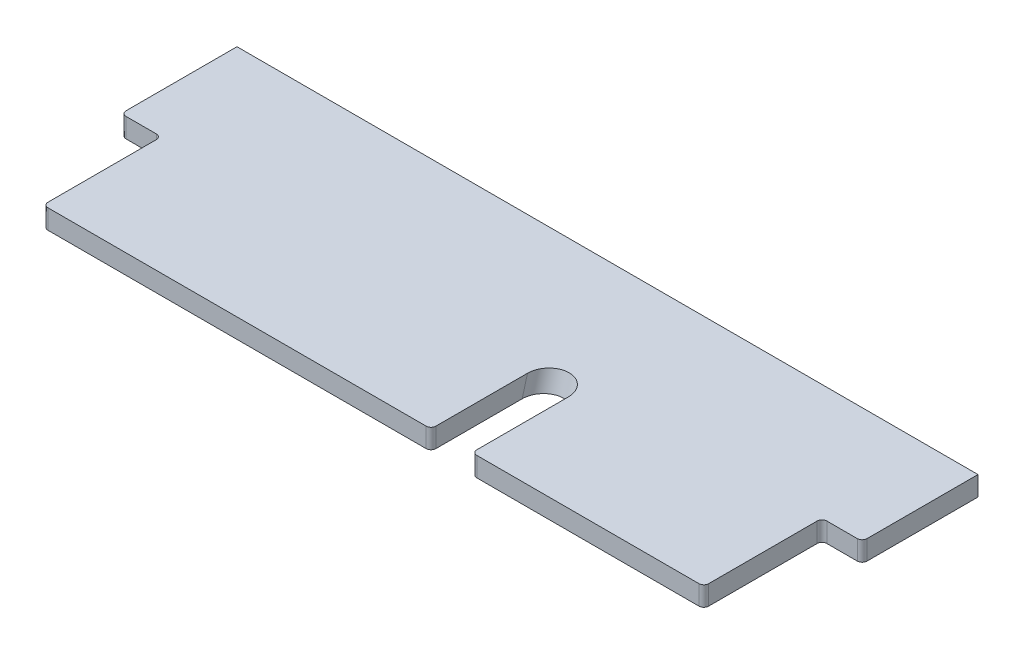
ISO-10303-21;
HEADER;
FILE_DESCRIPTION(('STEP AP214'),'2;1');
FILE_NAME('part.step','',(''),(''),'','','');
FILE_SCHEMA(('AUTOMOTIVE_DESIGN { 1 0 10303 214 1 1 1 1 }'));
ENDSEC;
DATA;
#1=APPLICATION_CONTEXT('core data for automotive mechanical design processes');
#2=APPLICATION_PROTOCOL_DEFINITION('international standard','automotive_design',2000,#1);
#3=PRODUCT_CONTEXT('',#1,'mechanical');
#4=PRODUCT('Part','Part','',(#3));
#5=PRODUCT_RELATED_PRODUCT_CATEGORY('part','',(#4));
#6=PRODUCT_DEFINITION_FORMATION('','',#4);
#7=PRODUCT_DEFINITION_CONTEXT('part definition',#1,'design');
#8=PRODUCT_DEFINITION('design','',#6,#7);
#9=PRODUCT_DEFINITION_SHAPE('','',#8);
#10=(LENGTH_UNIT() NAMED_UNIT(*) SI_UNIT(.MILLI.,.METRE.));
#11=(NAMED_UNIT(*) PLANE_ANGLE_UNIT() SI_UNIT($,.RADIAN.));
#12=(NAMED_UNIT(*) SI_UNIT($,.STERADIAN.) SOLID_ANGLE_UNIT());
#13=UNCERTAINTY_MEASURE_WITH_UNIT(LENGTH_MEASURE(1.E-05),#10,'distance_accuracy_value','');
#14=(GEOMETRIC_REPRESENTATION_CONTEXT(3) GLOBAL_UNCERTAINTY_ASSIGNED_CONTEXT((#13)) GLOBAL_UNIT_ASSIGNED_CONTEXT((#10,
#11,#12)) REPRESENTATION_CONTEXT('',''));
#15=CARTESIAN_POINT('',(0.,0.,0.));
#16=DIRECTION('',(0.,0.,1.));
#17=DIRECTION('',(1.,0.,0.));
#18=AXIS2_PLACEMENT_3D('',#15,#16,#17);
#19=CARTESIAN_POINT('',(-215.9,6.35,76.2));
#20=DIRECTION('',(0.,0.,-1.));
#21=DIRECTION('',(-1.,0.,0.));
#22=AXIS2_PLACEMENT_3D('',#19,#20,#21);
#23=PLANE('',#22);
#24=DIRECTION('',(1.,0.,0.));
#25=VECTOR('',#24,1.);
#26=CARTESIAN_POINT('',(-215.9,6.35,76.2));
#27=LINE('',#26,#25);
#28=CARTESIAN_POINT('',(-211.963,6.35,76.2));
#29=VERTEX_POINT('',#28);
#30=CARTESIAN_POINT('',(34.2899999999999,6.35,76.2));
#31=VERTEX_POINT('',#30);
#32=EDGE_CURVE('E222',#29,#31,#27,.T.);
#33=ORIENTED_EDGE('',*,*,#32,.F.);
#34=DIRECTION('',(0.,-1.,0.));
#35=VECTOR('',#34,1.);
#36=CARTESIAN_POINT('',(-211.963,6.35,76.2));
#37=LINE('',#36,#35);
#38=CARTESIAN_POINT('',(-211.963,-6.35,76.2));
#39=VERTEX_POINT('',#38);
#40=EDGE_CURVE('E344',#29,#39,#37,.T.);
#41=ORIENTED_EDGE('',*,*,#40,.T.);
#42=DIRECTION('',(1.,0.,0.));
#43=VECTOR('',#42,1.);
#44=CARTESIAN_POINT('',(-215.9,-6.35,76.2));
#45=LINE('',#44,#43);
#46=CARTESIAN_POINT('',(34.2899999999999,-6.35,76.2));
#47=VERTEX_POINT('',#46);
#48=EDGE_CURVE('E292',#39,#47,#45,.T.);
#49=ORIENTED_EDGE('',*,*,#48,.T.);
#50=DIRECTION('',(0.,-1.,0.));
#51=VECTOR('',#50,1.);
#52=CARTESIAN_POINT('',(34.2899999999999,6.35,76.2));
#53=LINE('',#52,#51);
#54=EDGE_CURVE('E60',#47,#31,#53,.F.);
#55=ORIENTED_EDGE('',*,*,#54,.T.);
#56=EDGE_LOOP('',(#33,#41,#49,#55));
#57=FACE_BOUND('',#56,.T.);
#58=ADVANCED_FACE('F44',(#57),#23,.F.);
#59=CARTESIAN_POINT('',(50.7999999999986,94.7896928963142,-10.6042856199856));
#60=DIRECTION('',(0.,-0.965182723476007,0.261576585923584));
#61=DIRECTION('',(0.,-0.261576585923584,-0.965182723476007));
#62=AXIS2_PLACEMENT_3D('',#59,#60,#61);
#63=CYLINDRICAL_SURFACE('',#62,13.3350000000001);
#64=CARTESIAN_POINT('',(50.7999999999986,6.34999999999999,13.363976933072));
#65=DIRECTION('',(0.,1.,0.));
#66=DIRECTION('',(0.,0.,1.));
#67=AXIS2_PLACEMENT_3D('',#64,#65,#66);
#68=ELLIPSE('',#67,13.8160367727838,13.3350000000001);
#69=CARTESIAN_POINT('',(37.4649999999999,6.34999999999999,13.363976933072));
#70=VERTEX_POINT('',#69);
#71=CARTESIAN_POINT('',(64.135,6.34999999999999,13.363976933072));
#72=VERTEX_POINT('',#71);
#73=EDGE_CURVE('E246',#70,#72,#68,.F.);
#74=ORIENTED_EDGE('',*,*,#73,.F.);
#75=DIRECTION('',(0.,-0.965182723476007,0.261576585923584));
#76=VECTOR('',#75,1.);
#77=CARTESIAN_POINT('',(37.4649999999985,94.7896928963142,-10.6042856199856));
#78=LINE('',#77,#76);
#79=CARTESIAN_POINT('',(37.4649999999999,-6.34999999999999,16.8058357235667));
#80=VERTEX_POINT('',#79);
#81=EDGE_CURVE('E269',#80,#70,#78,.F.);
#82=ORIENTED_EDGE('',*,*,#81,.F.);
#83=CARTESIAN_POINT('',(50.7999999999986,-6.34999999999999,16.8058357235667));
#84=DIRECTION('',(0.,1.,0.));
#85=DIRECTION('',(0.,0.,1.));
#86=AXIS2_PLACEMENT_3D('',#83,#84,#85);
#87=ELLIPSE('',#86,13.8160367727838,13.3350000000001);
#88=CARTESIAN_POINT('',(64.135,-6.34999999999999,16.8058357235667));
#89=VERTEX_POINT('',#88);
#90=EDGE_CURVE('E225',#80,#89,#87,.F.);
#91=ORIENTED_EDGE('',*,*,#90,.T.);
#92=DIRECTION('',(0.,-0.965182723476007,0.261576585923584));
#93=VECTOR('',#92,1.);
#94=CARTESIAN_POINT('',(64.1349999999987,94.7896928963142,-10.6042856199856));
#95=LINE('',#94,#93);
#96=EDGE_CURVE('E241',#89,#72,#95,.F.);
#97=ORIENTED_EDGE('',*,*,#96,.T.);
#98=EDGE_LOOP('',(#74,#82,#91,#97));
#99=FACE_BOUND('',#98,.T.);
#100=ADVANCED_FACE('F457',(#99),#63,.F.);
#101=CARTESIAN_POINT('',(215.138,6.35,0.));
#102=DIRECTION('',(-1.,0.,0.));
#103=DIRECTION('',(0.,0.,1.));
#104=AXIS2_PLACEMENT_3D('',#101,#102,#103);
#105=PLANE('',#104);
#106=DIRECTION('',(0.,0.,-1.));
#107=VECTOR('',#106,1.);
#108=CARTESIAN_POINT('',(215.138,6.35,0.));
#109=LINE('',#108,#107);
#110=CARTESIAN_POINT('',(215.138,6.35,73.025));
#111=VERTEX_POINT('',#110);
#112=CARTESIAN_POINT('',(215.138,6.35,2.41300000000001));
#113=VERTEX_POINT('',#112);
#114=EDGE_CURVE('E242',#111,#113,#109,.T.);
#115=ORIENTED_EDGE('',*,*,#114,.F.);
#116=DIRECTION('',(0.,-1.,0.));
#117=VECTOR('',#116,1.);
#118=CARTESIAN_POINT('',(215.138,6.35,73.025));
#119=LINE('',#118,#117);
#120=CARTESIAN_POINT('',(215.138,-6.35,73.025));
#121=VERTEX_POINT('',#120);
#122=EDGE_CURVE('E298',#111,#121,#119,.T.);
#123=ORIENTED_EDGE('',*,*,#122,.T.);
#124=DIRECTION('',(0.,0.,-1.));
#125=VECTOR('',#124,1.);
#126=CARTESIAN_POINT('',(215.138,-6.35,0.));
#127=LINE('',#126,#125);
#128=CARTESIAN_POINT('',(215.138,-6.35,2.41300000000001));
#129=VERTEX_POINT('',#128);
#130=EDGE_CURVE('E237',#121,#129,#127,.T.);
#131=ORIENTED_EDGE('',*,*,#130,.T.);
#132=DIRECTION('',(0.,-1.,0.));
#133=VECTOR('',#132,1.);
#134=CARTESIAN_POINT('',(215.138,6.35,2.41300000000001));
#135=LINE('',#134,#133);
#136=EDGE_CURVE('E281',#129,#113,#135,.F.);
#137=ORIENTED_EDGE('',*,*,#136,.T.);
#138=EDGE_LOOP('',(#115,#123,#131,#137));
#139=FACE_BOUND('',#138,.T.);
#140=ADVANCED_FACE('F396',(#139),#105,.F.);
#141=CARTESIAN_POINT('',(215.9,6.35,-0.761999999999986));
#142=DIRECTION('',(0.,0.,-1.));
#143=DIRECTION('',(-1.,0.,0.));
#144=AXIS2_PLACEMENT_3D('',#141,#142,#143);
#145=PLANE('',#144);
#146=DIRECTION('',(1.,0.,0.));
#147=VECTOR('',#146,1.);
#148=CARTESIAN_POINT('',(215.9,-6.35,-0.761999999999986));
#149=LINE('',#148,#147);
#150=CARTESIAN_POINT('',(218.313,-6.35,-0.761999999999986));
#151=VERTEX_POINT('',#150);
#152=CARTESIAN_POINT('',(238.125,-6.35,-0.761999999999986));
#153=VERTEX_POINT('',#152);
#154=EDGE_CURVE('E221',#151,#153,#149,.T.);
#155=ORIENTED_EDGE('',*,*,#154,.T.);
#156=DIRECTION('',(0.,-1.,0.));
#157=VECTOR('',#156,1.);
#158=CARTESIAN_POINT('',(238.125,6.35,-0.761999999999986));
#159=LINE('',#158,#157);
#160=CARTESIAN_POINT('',(238.125,6.35,-0.761999999999986));
#161=VERTEX_POINT('',#160);
#162=EDGE_CURVE('E373',#153,#161,#159,.F.);
#163=ORIENTED_EDGE('',*,*,#162,.T.);
#164=DIRECTION('',(1.,0.,0.));
#165=VECTOR('',#164,1.);
#166=CARTESIAN_POINT('',(215.9,6.35,-0.761999999999986));
#167=LINE('',#166,#165);
#168=CARTESIAN_POINT('',(218.313,6.35,-0.761999999999986));
#169=VERTEX_POINT('',#168);
#170=EDGE_CURVE('E236',#169,#161,#167,.T.);
#171=ORIENTED_EDGE('',*,*,#170,.F.);
#172=DIRECTION('',(0.,-1.,0.));
#173=VECTOR('',#172,1.);
#174=CARTESIAN_POINT('',(218.313,-6.35,-0.761999999999986));
#175=LINE('',#174,#173);
#176=EDGE_CURVE('E369',#169,#151,#175,.T.);
#177=ORIENTED_EDGE('',*,*,#176,.T.);
#178=EDGE_LOOP('',(#155,#163,#171,#177));
#179=FACE_BOUND('',#178,.T.);
#180=ADVANCED_FACE('F405',(#179),#145,.F.);
#181=CARTESIAN_POINT('',(241.3,6.35,-76.2));
#182=DIRECTION('',(-1.,0.,0.));
#183=DIRECTION('',(0.,0.,1.));
#184=AXIS2_PLACEMENT_3D('',#181,#182,#183);
#185=PLANE('',#184);
#186=DIRECTION('',(0.,0.,-1.));
#187=VECTOR('',#186,1.);
#188=CARTESIAN_POINT('',(241.3,6.35,-76.2));
#189=LINE('',#188,#187);
#190=CARTESIAN_POINT('',(241.3,6.35,-3.93700000000001));
#191=VERTEX_POINT('',#190);
#192=CARTESIAN_POINT('',(241.3,6.35,-76.2));
#193=VERTEX_POINT('',#192);
#194=EDGE_CURVE('E233',#191,#193,#189,.T.);
#195=ORIENTED_EDGE('',*,*,#194,.F.);
#196=DIRECTION('',(0.,-1.,0.));
#197=VECTOR('',#196,1.);
#198=CARTESIAN_POINT('',(241.3,6.35,-3.93699999999998));
#199=LINE('',#198,#197);
#200=CARTESIAN_POINT('',(241.3,-6.35,-3.93700000000001));
#201=VERTEX_POINT('',#200);
#202=EDGE_CURVE('E365',#191,#201,#199,.T.);
#203=ORIENTED_EDGE('',*,*,#202,.T.);
#204=DIRECTION('',(0.,0.,-1.));
#205=VECTOR('',#204,1.);
#206=CARTESIAN_POINT('',(241.3,-6.35,-76.2));
#207=LINE('',#206,#205);
#208=CARTESIAN_POINT('',(241.3,-6.35,-76.2));
#209=VERTEX_POINT('',#208);
#210=EDGE_CURVE('E196',#201,#209,#207,.T.);
#211=ORIENTED_EDGE('',*,*,#210,.T.);
#212=DIRECTION('',(0.,-1.,0.));
#213=VECTOR('',#212,1.);
#214=CARTESIAN_POINT('',(241.3,6.35,-76.2));
#215=LINE('',#214,#213);
#216=EDGE_CURVE('E191',#193,#209,#215,.T.);
#217=ORIENTED_EDGE('',*,*,#216,.F.);
#218=EDGE_LOOP('',(#195,#203,#211,#217));
#219=FACE_BOUND('',#218,.T.);
#220=ADVANCED_FACE('F412',(#219),#185,.F.);
#221=CARTESIAN_POINT('',(-215.9,6.35,-76.2));
#222=DIRECTION('',(0.,0.,1.));
#223=DIRECTION('',(1.,0.,0.));
#224=AXIS2_PLACEMENT_3D('',#221,#222,#223);
#225=PLANE('',#224);
#226=DIRECTION('',(-1.,0.,0.));
#227=VECTOR('',#226,1.);
#228=CARTESIAN_POINT('',(-215.9,-6.35,-76.2));
#229=LINE('',#228,#227);
#230=CARTESIAN_POINT('',(-241.3,-6.35,-76.2));
#231=VERTEX_POINT('',#230);
#232=EDGE_CURVE('E184',#209,#231,#229,.T.);
#233=ORIENTED_EDGE('',*,*,#232,.T.);
#234=DIRECTION('',(0.,-1.,0.));
#235=VECTOR('',#234,1.);
#236=CARTESIAN_POINT('',(-241.3,6.35,-76.2));
#237=LINE('',#236,#235);
#238=CARTESIAN_POINT('',(-241.3,6.35,-76.2));
#239=VERTEX_POINT('',#238);
#240=EDGE_CURVE('E188',#239,#231,#237,.T.);
#241=ORIENTED_EDGE('',*,*,#240,.F.);
#242=DIRECTION('',(-1.,0.,0.));
#243=VECTOR('',#242,1.);
#244=CARTESIAN_POINT('',(215.9,6.35,-76.2));
#245=LINE('',#244,#243);
#246=EDGE_CURVE('E230',#193,#239,#245,.T.);
#247=ORIENTED_EDGE('',*,*,#246,.F.);
#248=ORIENTED_EDGE('',*,*,#216,.T.);
#249=EDGE_LOOP('',(#233,#241,#247,#248));
#250=FACE_BOUND('',#249,.T.);
#251=ADVANCED_FACE('F186',(#250),#225,.F.);
#252=CARTESIAN_POINT('',(-241.3,6.35,-76.2));
#253=DIRECTION('',(1.,0.,0.));
#254=DIRECTION('',(0.,0.,-1.));
#255=AXIS2_PLACEMENT_3D('',#252,#253,#254);
#256=PLANE('',#255);
#257=DIRECTION('',(0.,0.,1.));
#258=VECTOR('',#257,1.);
#259=CARTESIAN_POINT('',(-241.3,-6.35,-76.2));
#260=LINE('',#259,#258);
#261=CARTESIAN_POINT('',(-241.3,-6.35,-3.93700000000001));
#262=VERTEX_POINT('',#261);
#263=EDGE_CURVE('E201',#231,#262,#260,.T.);
#264=ORIENTED_EDGE('',*,*,#263,.T.);
#265=DIRECTION('',(0.,-1.,0.));
#266=VECTOR('',#265,1.);
#267=CARTESIAN_POINT('',(-241.3,6.35,-3.93699999999998));
#268=LINE('',#267,#266);
#269=CARTESIAN_POINT('',(-241.3,6.35,-3.93700000000001));
#270=VERTEX_POINT('',#269);
#271=EDGE_CURVE('E362',#262,#270,#268,.F.);
#272=ORIENTED_EDGE('',*,*,#271,.T.);
#273=DIRECTION('',(0.,0.,1.));
#274=VECTOR('',#273,1.);
#275=CARTESIAN_POINT('',(-241.3,6.35,-76.2));
#276=LINE('',#275,#274);
#277=EDGE_CURVE('E204',#239,#270,#276,.T.);
#278=ORIENTED_EDGE('',*,*,#277,.F.);
#279=ORIENTED_EDGE('',*,*,#240,.T.);
#280=EDGE_LOOP('',(#264,#272,#278,#279));
#281=FACE_BOUND('',#280,.T.);
#282=ADVANCED_FACE('F200',(#281),#256,.F.);
#283=CARTESIAN_POINT('',(-215.9,6.35,-0.76199999999999));
#284=DIRECTION('',(0.,0.,-1.));
#285=DIRECTION('',(-1.,0.,0.));
#286=AXIS2_PLACEMENT_3D('',#283,#284,#285);
#287=PLANE('',#286);
#288=DIRECTION('',(1.,0.,0.));
#289=VECTOR('',#288,1.);
#290=CARTESIAN_POINT('',(-215.9,-6.35,-0.76199999999999));
#291=LINE('',#290,#289);
#292=CARTESIAN_POINT('',(-238.125,-6.35,-0.761999999999987));
#293=VERTEX_POINT('',#292);
#294=CARTESIAN_POINT('',(-218.313,-6.35,-0.761999999999989));
#295=VERTEX_POINT('',#294);
#296=EDGE_CURVE('E206',#293,#295,#291,.T.);
#297=ORIENTED_EDGE('',*,*,#296,.T.);
#298=DIRECTION('',(0.,-1.,0.));
#299=VECTOR('',#298,1.);
#300=CARTESIAN_POINT('',(-218.313,6.35,-0.761999999999989));
#301=LINE('',#300,#299);
#302=CARTESIAN_POINT('',(-218.313,6.35,-0.761999999999989));
#303=VERTEX_POINT('',#302);
#304=EDGE_CURVE('E359',#295,#303,#301,.F.);
#305=ORIENTED_EDGE('',*,*,#304,.T.);
#306=DIRECTION('',(1.,0.,0.));
#307=VECTOR('',#306,1.);
#308=CARTESIAN_POINT('',(-215.9,6.35,-0.76199999999999));
#309=LINE('',#308,#307);
#310=CARTESIAN_POINT('',(-238.125,6.35,-0.761999999999987));
#311=VERTEX_POINT('',#310);
#312=EDGE_CURVE('E229',#311,#303,#309,.T.);
#313=ORIENTED_EDGE('',*,*,#312,.F.);
#314=DIRECTION('',(0.,-1.,0.));
#315=VECTOR('',#314,1.);
#316=CARTESIAN_POINT('',(-238.125,6.35,-0.761999999999987));
#317=LINE('',#316,#315);
#318=EDGE_CURVE('E355',#311,#293,#317,.T.);
#319=ORIENTED_EDGE('',*,*,#318,.T.);
#320=EDGE_LOOP('',(#297,#305,#313,#319));
#321=FACE_BOUND('',#320,.T.);
#322=ADVANCED_FACE('F419',(#321),#287,.F.);
#323=CARTESIAN_POINT('',(-215.138,6.35,0.));
#324=DIRECTION('',(1.,0.,0.));
#325=DIRECTION('',(0.,0.,-1.));
#326=AXIS2_PLACEMENT_3D('',#323,#324,#325);
#327=PLANE('',#326);
#328=DIRECTION('',(0.,0.,1.));
#329=VECTOR('',#328,1.);
#330=CARTESIAN_POINT('',(-215.138,-6.35,0.));
#331=LINE('',#330,#329);
#332=CARTESIAN_POINT('',(-215.138,-6.35,2.41300000000001));
#333=VERTEX_POINT('',#332);
#334=CARTESIAN_POINT('',(-215.138,-6.35,73.025));
#335=VERTEX_POINT('',#334);
#336=EDGE_CURVE('E253',#333,#335,#331,.T.);
#337=ORIENTED_EDGE('',*,*,#336,.T.);
#338=DIRECTION('',(0.,-1.,0.));
#339=VECTOR('',#338,1.);
#340=CARTESIAN_POINT('',(-215.138,6.35,73.025));
#341=LINE('',#340,#339);
#342=CARTESIAN_POINT('',(-215.138,6.35,73.025));
#343=VERTEX_POINT('',#342);
#344=EDGE_CURVE('E352',#335,#343,#341,.F.);
#345=ORIENTED_EDGE('',*,*,#344,.T.);
#346=DIRECTION('',(0.,0.,1.));
#347=VECTOR('',#346,1.);
#348=CARTESIAN_POINT('',(-215.138,6.35,0.));
#349=LINE('',#348,#347);
#350=CARTESIAN_POINT('',(-215.138,6.35,2.41300000000001));
#351=VERTEX_POINT('',#350);
#352=EDGE_CURVE('E263',#351,#343,#349,.T.);
#353=ORIENTED_EDGE('',*,*,#352,.F.);
#354=DIRECTION('',(0.,-1.,0.));
#355=VECTOR('',#354,1.);
#356=CARTESIAN_POINT('',(-215.138,-6.35,2.41300000000001));
#357=LINE('',#356,#355);
#358=EDGE_CURVE('E348',#351,#333,#357,.T.);
#359=ORIENTED_EDGE('',*,*,#358,.T.);
#360=EDGE_LOOP('',(#337,#345,#353,#359));
#361=FACE_BOUND('',#360,.T.);
#362=ADVANCED_FACE('F428',(#361),#327,.F.);
#363=CARTESIAN_POINT('',(67.31,-6.35,76.2));
#364=VERTEX_POINT('',#363);
#365=CARTESIAN_POINT('',(211.963,-6.35,76.2));
#366=VERTEX_POINT('',#365);
#367=EDGE_CURVE('E217',#364,#366,#45,.T.);
#368=ORIENTED_EDGE('',*,*,#367,.T.);
#369=DIRECTION('',(0.,-1.,0.));
#370=VECTOR('',#369,1.);
#371=CARTESIAN_POINT('',(211.963,6.35,76.2));
#372=LINE('',#371,#370);
#373=CARTESIAN_POINT('',(211.963,6.35,76.2));
#374=VERTEX_POINT('',#373);
#375=EDGE_CURVE('E322',#366,#374,#372,.F.);
#376=ORIENTED_EDGE('',*,*,#375,.T.);
#377=CARTESIAN_POINT('',(67.31,6.35,76.2));
#378=VERTEX_POINT('',#377);
#379=EDGE_CURVE('E226',#378,#374,#27,.T.);
#380=ORIENTED_EDGE('',*,*,#379,.F.);
#381=DIRECTION('',(0.,1.,0.));
#382=VECTOR('',#381,1.);
#383=CARTESIAN_POINT('',(67.31,6.35,76.2));
#384=LINE('',#383,#382);
#385=EDGE_CURVE('E319',#378,#364,#384,.F.);
#386=ORIENTED_EDGE('',*,*,#385,.T.);
#387=EDGE_LOOP('',(#368,#376,#380,#386));
#388=FACE_BOUND('',#387,.T.);
#389=ADVANCED_FACE('F440',(#388),#23,.F.);
#390=CARTESIAN_POINT('',(0.,6.35,0.));
#391=DIRECTION('',(0.,1.,0.));
#392=DIRECTION('',(0.,0.,1.));
#393=AXIS2_PLACEMENT_3D('',#390,#391,#392);
#394=PLANE('',#393);
#395=ORIENTED_EDGE('',*,*,#379,.T.);
#396=CARTESIAN_POINT('',(211.963,6.35,73.025));
#397=DIRECTION('',(0.,1.,0.));
#398=DIRECTION('',(0.,0.,1.));
#399=AXIS2_PLACEMENT_3D('',#396,#397,#398);
#400=CIRCLE('',#399,3.175);
#401=EDGE_CURVE('E339',#374,#111,#400,.T.);
#402=ORIENTED_EDGE('',*,*,#401,.T.);
#403=ORIENTED_EDGE('',*,*,#114,.T.);
#404=CARTESIAN_POINT('',(218.313,6.35,2.41300000000001));
#405=DIRECTION('',(0.,1.,0.));
#406=DIRECTION('',(0.,0.,1.));
#407=AXIS2_PLACEMENT_3D('',#404,#405,#406);
#408=CIRCLE('',#407,3.175);
#409=EDGE_CURVE('E12',#113,#169,#408,.F.);
#410=ORIENTED_EDGE('',*,*,#409,.T.);
#411=ORIENTED_EDGE('',*,*,#170,.T.);
#412=CARTESIAN_POINT('',(238.125,6.35,-3.93699999999998));
#413=DIRECTION('',(0.,1.,0.));
#414=DIRECTION('',(0.,0.,1.));
#415=AXIS2_PLACEMENT_3D('',#412,#413,#414);
#416=CIRCLE('',#415,3.175);
#417=EDGE_CURVE('E331',#161,#191,#416,.T.);
#418=ORIENTED_EDGE('',*,*,#417,.T.);
#419=ORIENTED_EDGE('',*,*,#194,.T.);
#420=ORIENTED_EDGE('',*,*,#246,.T.);
#421=ORIENTED_EDGE('',*,*,#277,.T.);
#422=CARTESIAN_POINT('',(-238.125,6.35,-3.93699999999999));
#423=DIRECTION('',(0.,1.,0.));
#424=DIRECTION('',(0.,0.,1.));
#425=AXIS2_PLACEMENT_3D('',#422,#423,#424);
#426=CIRCLE('',#425,3.175);
#427=EDGE_CURVE('E334',#270,#311,#426,.T.);
#428=ORIENTED_EDGE('',*,*,#427,.T.);
#429=ORIENTED_EDGE('',*,*,#312,.T.);
#430=CARTESIAN_POINT('',(-218.313,6.35,2.41300000000001));
#431=DIRECTION('',(0.,1.,0.));
#432=DIRECTION('',(0.,0.,1.));
#433=AXIS2_PLACEMENT_3D('',#430,#431,#432);
#434=CIRCLE('',#433,3.175);
#435=EDGE_CURVE('E387',#303,#351,#434,.F.);
#436=ORIENTED_EDGE('',*,*,#435,.T.);
#437=ORIENTED_EDGE('',*,*,#352,.T.);
#438=CARTESIAN_POINT('',(-211.963,6.35,73.025));
#439=DIRECTION('',(0.,1.,0.));
#440=DIRECTION('',(0.,0.,1.));
#441=AXIS2_PLACEMENT_3D('',#438,#439,#440);
#442=CIRCLE('',#441,3.175);
#443=EDGE_CURVE('E67',#343,#29,#442,.T.);
#444=ORIENTED_EDGE('',*,*,#443,.T.);
#445=ORIENTED_EDGE('',*,*,#32,.T.);
#446=CARTESIAN_POINT('',(34.2899999999999,6.35,73.025));
#447=DIRECTION('',(0.,1.,0.));
#448=DIRECTION('',(0.,0.,1.));
#449=AXIS2_PLACEMENT_3D('',#446,#447,#448);
#450=CIRCLE('',#449,3.175);
#451=CARTESIAN_POINT('',(37.4649999999999,6.35,73.025));
#452=VERTEX_POINT('',#451);
#453=EDGE_CURVE('E325',#31,#452,#450,.T.);
#454=ORIENTED_EDGE('',*,*,#453,.T.);
#455=DIRECTION('',(0.,0.,1.));
#456=VECTOR('',#455,1.);
#457=CARTESIAN_POINT('',(37.4649999999999,6.35,0.));
#458=LINE('',#457,#456);
#459=EDGE_CURVE('E285',#70,#452,#458,.T.);
#460=ORIENTED_EDGE('',*,*,#459,.F.);
#461=ORIENTED_EDGE('',*,*,#73,.T.);
#462=DIRECTION('',(0.,0.,1.));
#463=VECTOR('',#462,1.);
#464=CARTESIAN_POINT('',(64.135,6.35,-76.201));
#465=LINE('',#464,#463);
#466=CARTESIAN_POINT('',(64.135,6.35,73.025));
#467=VERTEX_POINT('',#466);
#468=EDGE_CURVE('E272',#72,#467,#465,.T.);
#469=ORIENTED_EDGE('',*,*,#468,.T.);
#470=CARTESIAN_POINT('',(67.31,6.35,73.025));
#471=DIRECTION('',(0.,1.,0.));
#472=DIRECTION('',(0.,0.,1.));
#473=AXIS2_PLACEMENT_3D('',#470,#471,#472);
#474=CIRCLE('',#473,3.175);
#475=EDGE_CURVE('E328',#467,#378,#474,.T.);
#476=ORIENTED_EDGE('',*,*,#475,.T.);
#477=EDGE_LOOP('',(#395,#402,#403,#410,#411,#418,#419,#420,#421,#428,#429,#436,#437,#444,#445,
#454,#460,#461,#469,#476));
#478=FACE_BOUND('',#477,.T.);
#479=ADVANCED_FACE('F402',(#478),#394,.T.);
#480=CARTESIAN_POINT('',(0.,-6.35,0.));
#481=DIRECTION('',(0.,1.,0.));
#482=DIRECTION('',(0.,0.,1.));
#483=AXIS2_PLACEMENT_3D('',#480,#481,#482);
#484=PLANE('',#483);
#485=ORIENTED_EDGE('',*,*,#130,.F.);
#486=CARTESIAN_POINT('',(211.963,-6.35,73.025));
#487=DIRECTION('',(0.,1.,0.));
#488=DIRECTION('',(0.,0.,1.));
#489=AXIS2_PLACEMENT_3D('',#486,#487,#488);
#490=CIRCLE('',#489,3.175);
#491=EDGE_CURVE('E316',#121,#366,#490,.F.);
#492=ORIENTED_EDGE('',*,*,#491,.T.);
#493=ORIENTED_EDGE('',*,*,#367,.F.);
#494=CARTESIAN_POINT('',(67.31,-6.35,73.025));
#495=DIRECTION('',(0.,1.,0.));
#496=DIRECTION('',(0.,0.,1.));
#497=AXIS2_PLACEMENT_3D('',#494,#495,#496);
#498=CIRCLE('',#497,3.175);
#499=CARTESIAN_POINT('',(64.135,-6.35,73.025));
#500=VERTEX_POINT('',#499);
#501=EDGE_CURVE('E305',#364,#500,#498,.F.);
#502=ORIENTED_EDGE('',*,*,#501,.T.);
#503=DIRECTION('',(0.,0.,1.));
#504=VECTOR('',#503,1.);
#505=CARTESIAN_POINT('',(64.135,-6.35,-76.201));
#506=LINE('',#505,#504);
#507=EDGE_CURVE('E273',#89,#500,#506,.T.);
#508=ORIENTED_EDGE('',*,*,#507,.F.);
#509=ORIENTED_EDGE('',*,*,#90,.F.);
#510=DIRECTION('',(0.,0.,1.));
#511=VECTOR('',#510,1.);
#512=CARTESIAN_POINT('',(37.4649999999999,-6.35,0.));
#513=LINE('',#512,#511);
#514=CARTESIAN_POINT('',(37.4649999999999,-6.35,73.025));
#515=VERTEX_POINT('',#514);
#516=EDGE_CURVE('E277',#80,#515,#513,.T.);
#517=ORIENTED_EDGE('',*,*,#516,.T.);
#518=CARTESIAN_POINT('',(34.2899999999999,-6.35,73.025));
#519=DIRECTION('',(0.,1.,0.));
#520=DIRECTION('',(0.,0.,1.));
#521=AXIS2_PLACEMENT_3D('',#518,#519,#520);
#522=CIRCLE('',#521,3.175);
#523=EDGE_CURVE('E302',#515,#47,#522,.F.);
#524=ORIENTED_EDGE('',*,*,#523,.T.);
#525=ORIENTED_EDGE('',*,*,#48,.F.);
#526=CARTESIAN_POINT('',(-211.963,-6.35,73.025));
#527=DIRECTION('',(0.,1.,0.));
#528=DIRECTION('',(0.,0.,1.));
#529=AXIS2_PLACEMENT_3D('',#526,#527,#528);
#530=CIRCLE('',#529,3.175);
#531=EDGE_CURVE('E313',#39,#335,#530,.F.);
#532=ORIENTED_EDGE('',*,*,#531,.T.);
#533=ORIENTED_EDGE('',*,*,#336,.F.);
#534=CARTESIAN_POINT('',(-218.313,-6.35,2.41300000000001));
#535=DIRECTION('',(0.,1.,0.));
#536=DIRECTION('',(0.,0.,1.));
#537=AXIS2_PLACEMENT_3D('',#534,#535,#536);
#538=CIRCLE('',#537,3.175);
#539=EDGE_CURVE('E384',#333,#295,#538,.T.);
#540=ORIENTED_EDGE('',*,*,#539,.T.);
#541=ORIENTED_EDGE('',*,*,#296,.F.);
#542=CARTESIAN_POINT('',(-238.125,-6.35,-3.93699999999999));
#543=DIRECTION('',(0.,1.,0.));
#544=DIRECTION('',(0.,0.,1.));
#545=AXIS2_PLACEMENT_3D('',#542,#543,#544);
#546=CIRCLE('',#545,3.175);
#547=EDGE_CURVE('E211',#293,#262,#546,.F.);
#548=ORIENTED_EDGE('',*,*,#547,.T.);
#549=ORIENTED_EDGE('',*,*,#263,.F.);
#550=ORIENTED_EDGE('',*,*,#232,.F.);
#551=ORIENTED_EDGE('',*,*,#210,.F.);
#552=CARTESIAN_POINT('',(238.125,-6.35,-3.93699999999998));
#553=DIRECTION('',(0.,1.,0.));
#554=DIRECTION('',(0.,0.,1.));
#555=AXIS2_PLACEMENT_3D('',#552,#553,#554);
#556=CIRCLE('',#555,3.175);
#557=EDGE_CURVE('E308',#201,#153,#556,.F.);
#558=ORIENTED_EDGE('',*,*,#557,.T.);
#559=ORIENTED_EDGE('',*,*,#154,.F.);
#560=CARTESIAN_POINT('',(218.313,-6.35,2.41300000000001));
#561=DIRECTION('',(0.,1.,0.));
#562=DIRECTION('',(0.,0.,1.));
#563=AXIS2_PLACEMENT_3D('',#560,#561,#562);
#564=CIRCLE('',#563,3.175);
#565=EDGE_CURVE('E53',#151,#129,#564,.T.);
#566=ORIENTED_EDGE('',*,*,#565,.T.);
#567=EDGE_LOOP('',(#485,#492,#493,#502,#508,#509,#517,#524,#525,#532,#533,#540,#541,#548,#549,
#550,#551,#558,#559,#566));
#568=FACE_BOUND('',#567,.T.);
#569=ADVANCED_FACE('F209',(#568),#484,.F.);
#570=CARTESIAN_POINT('',(64.135,6.34999999999999,-76.201));
#571=DIRECTION('',(1.,0.,0.));
#572=DIRECTION('',(0.,0.,-1.));
#573=AXIS2_PLACEMENT_3D('',#570,#571,#572);
#574=PLANE('',#573);
#575=ORIENTED_EDGE('',*,*,#507,.T.);
#576=DIRECTION('',(0.,1.,0.));
#577=VECTOR('',#576,1.);
#578=CARTESIAN_POINT('',(64.135,6.34999999999999,73.025));
#579=LINE('',#578,#577);
#580=EDGE_CURVE('E376',#500,#467,#579,.T.);
#581=ORIENTED_EDGE('',*,*,#580,.T.);
#582=ORIENTED_EDGE('',*,*,#468,.F.);
#583=ORIENTED_EDGE('',*,*,#96,.F.);
#584=EDGE_LOOP('',(#575,#581,#582,#583));
#585=FACE_BOUND('',#584,.T.);
#586=ADVANCED_FACE('F454',(#585),#574,.F.);
#587=CARTESIAN_POINT('',(37.4649999999999,6.34999999999999,-76.201));
#588=DIRECTION('',(-1.,0.,0.));
#589=DIRECTION('',(0.,0.,1.));
#590=AXIS2_PLACEMENT_3D('',#587,#588,#589);
#591=PLANE('',#590);
#592=ORIENTED_EDGE('',*,*,#459,.T.);
#593=DIRECTION('',(0.,-1.,0.));
#594=VECTOR('',#593,1.);
#595=CARTESIAN_POINT('',(37.4649999999999,6.34999999999999,73.025));
#596=LINE('',#595,#594);
#597=EDGE_CURVE('E380',#452,#515,#596,.T.);
#598=ORIENTED_EDGE('',*,*,#597,.T.);
#599=ORIENTED_EDGE('',*,*,#516,.F.);
#600=ORIENTED_EDGE('',*,*,#81,.T.);
#601=EDGE_LOOP('',(#592,#598,#599,#600));
#602=FACE_BOUND('',#601,.T.);
#603=ADVANCED_FACE('F463',(#602),#591,.F.);
#604=CARTESIAN_POINT('',(211.963,6.35,73.025));
#605=DIRECTION('',(0.,-1.,0.));
#606=DIRECTION('',(0.,0.,-1.));
#607=AXIS2_PLACEMENT_3D('',#604,#605,#606);
#608=CYLINDRICAL_SURFACE('',#607,3.175);
#609=ORIENTED_EDGE('',*,*,#401,.F.);
#610=ORIENTED_EDGE('',*,*,#375,.F.);
#611=ORIENTED_EDGE('',*,*,#491,.F.);
#612=ORIENTED_EDGE('',*,*,#122,.F.);
#613=EDGE_LOOP('',(#609,#610,#611,#612));
#614=FACE_BOUND('',#613,.T.);
#615=ADVANCED_FACE('F446',(#614),#608,.T.);
#616=CARTESIAN_POINT('',(-211.963,6.35,73.025));
#617=DIRECTION('',(0.,-1.,0.));
#618=DIRECTION('',(0.,0.,-1.));
#619=AXIS2_PLACEMENT_3D('',#616,#617,#618);
#620=CYLINDRICAL_SURFACE('',#619,3.175);
#621=ORIENTED_EDGE('',*,*,#443,.F.);
#622=ORIENTED_EDGE('',*,*,#344,.F.);
#623=ORIENTED_EDGE('',*,*,#531,.F.);
#624=ORIENTED_EDGE('',*,*,#40,.F.);
#625=EDGE_LOOP('',(#621,#622,#623,#624));
#626=FACE_BOUND('',#625,.T.);
#627=ADVANCED_FACE('F432',(#626),#620,.T.);
#628=CARTESIAN_POINT('',(-218.313,6.35,2.41300000000001));
#629=DIRECTION('',(0.,1.,0.));
#630=DIRECTION('',(0.,0.,1.));
#631=AXIS2_PLACEMENT_3D('',#628,#629,#630);
#632=CYLINDRICAL_SURFACE('',#631,3.175);
#633=ORIENTED_EDGE('',*,*,#435,.F.);
#634=ORIENTED_EDGE('',*,*,#304,.F.);
#635=ORIENTED_EDGE('',*,*,#539,.F.);
#636=ORIENTED_EDGE('',*,*,#358,.F.);
#637=EDGE_LOOP('',(#633,#634,#635,#636));
#638=FACE_BOUND('',#637,.T.);
#639=ADVANCED_FACE('F425',(#638),#632,.F.);
#640=CARTESIAN_POINT('',(-238.125,6.35,-3.93699999999999));
#641=DIRECTION('',(0.,-1.,0.));
#642=DIRECTION('',(0.,0.,-1.));
#643=AXIS2_PLACEMENT_3D('',#640,#641,#642);
#644=CYLINDRICAL_SURFACE('',#643,3.175);
#645=ORIENTED_EDGE('',*,*,#427,.F.);
#646=ORIENTED_EDGE('',*,*,#271,.F.);
#647=ORIENTED_EDGE('',*,*,#547,.F.);
#648=ORIENTED_EDGE('',*,*,#318,.F.);
#649=EDGE_LOOP('',(#645,#646,#647,#648));
#650=FACE_BOUND('',#649,.T.);
#651=ADVANCED_FACE('F417',(#650),#644,.T.);
#652=CARTESIAN_POINT('',(238.125,6.35,-3.93699999999998));
#653=DIRECTION('',(0.,-1.,0.));
#654=DIRECTION('',(0.,0.,-1.));
#655=AXIS2_PLACEMENT_3D('',#652,#653,#654);
#656=CYLINDRICAL_SURFACE('',#655,3.175);
#657=ORIENTED_EDGE('',*,*,#417,.F.);
#658=ORIENTED_EDGE('',*,*,#162,.F.);
#659=ORIENTED_EDGE('',*,*,#557,.F.);
#660=ORIENTED_EDGE('',*,*,#202,.F.);
#661=EDGE_LOOP('',(#657,#658,#659,#660));
#662=FACE_BOUND('',#661,.T.);
#663=ADVANCED_FACE('F408',(#662),#656,.T.);
#664=CARTESIAN_POINT('',(218.313,6.35,2.41300000000001));
#665=DIRECTION('',(0.,1.,0.));
#666=DIRECTION('',(0.,0.,1.));
#667=AXIS2_PLACEMENT_3D('',#664,#665,#666);
#668=CYLINDRICAL_SURFACE('',#667,3.175);
#669=ORIENTED_EDGE('',*,*,#409,.F.);
#670=ORIENTED_EDGE('',*,*,#136,.F.);
#671=ORIENTED_EDGE('',*,*,#565,.F.);
#672=ORIENTED_EDGE('',*,*,#176,.F.);
#673=EDGE_LOOP('',(#669,#670,#671,#672));
#674=FACE_BOUND('',#673,.T.);
#675=ADVANCED_FACE('F399',(#674),#668,.F.);
#676=CARTESIAN_POINT('',(67.31,6.34999999999999,73.025));
#677=DIRECTION('',(0.,1.,0.));
#678=DIRECTION('',(0.,0.,1.));
#679=AXIS2_PLACEMENT_3D('',#676,#677,#678);
#680=CYLINDRICAL_SURFACE('',#679,3.175);
#681=ORIENTED_EDGE('',*,*,#501,.F.);
#682=ORIENTED_EDGE('',*,*,#385,.F.);
#683=ORIENTED_EDGE('',*,*,#475,.F.);
#684=ORIENTED_EDGE('',*,*,#580,.F.);
#685=EDGE_LOOP('',(#681,#682,#683,#684));
#686=FACE_BOUND('',#685,.T.);
#687=ADVANCED_FACE('F449',(#686),#680,.T.);
#688=CARTESIAN_POINT('',(34.2899999999999,6.34999999999999,73.025));
#689=DIRECTION('',(0.,-1.,0.));
#690=DIRECTION('',(0.,0.,-1.));
#691=AXIS2_PLACEMENT_3D('',#688,#689,#690);
#692=CYLINDRICAL_SURFACE('',#691,3.175);
#693=ORIENTED_EDGE('',*,*,#453,.F.);
#694=ORIENTED_EDGE('',*,*,#54,.F.);
#695=ORIENTED_EDGE('',*,*,#523,.F.);
#696=ORIENTED_EDGE('',*,*,#597,.F.);
#697=EDGE_LOOP('',(#693,#694,#695,#696));
#698=FACE_BOUND('',#697,.T.);
#699=ADVANCED_FACE('F46',(#698),#692,.T.);
#700=CLOSED_SHELL('',(#58,#100,#140,#180,#220,#251,#282,#322,#362,#389,#479,#569,#586,#603,#615,
#627,#639,#651,#663,#675,#687,#699));
#701=MANIFOLD_SOLID_BREP('B2',#700);
#702=ADVANCED_BREP_SHAPE_REPRESENTATION('',(#18,#701),#14);
#703=SHAPE_DEFINITION_REPRESENTATION(#9,#702);
ENDSEC;
END-ISO-10303-21;
